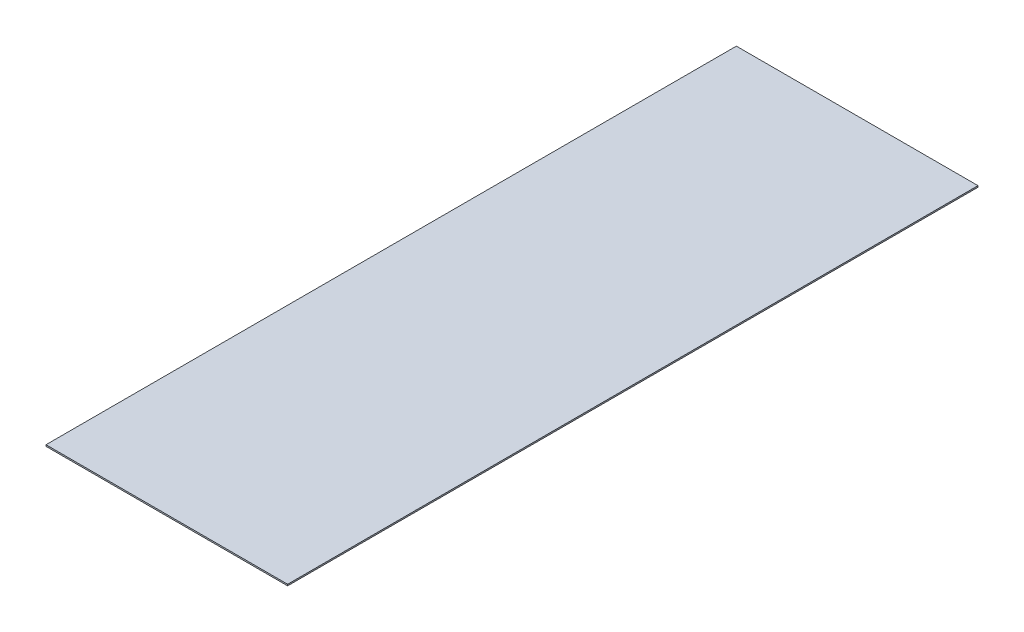
ISO-10303-21;
HEADER;
FILE_DESCRIPTION(('STEP AP214'),'2;1');
FILE_NAME('part.step','',(''),(''),'','','');
FILE_SCHEMA(('AUTOMOTIVE_DESIGN { 1 0 10303 214 1 1 1 1 }'));
ENDSEC;
DATA;
#1=APPLICATION_CONTEXT('core data for automotive mechanical design processes');
#2=APPLICATION_PROTOCOL_DEFINITION('international standard','automotive_design',2000,#1);
#3=PRODUCT_CONTEXT('',#1,'mechanical');
#4=PRODUCT('Part','Part','',(#3));
#5=PRODUCT_RELATED_PRODUCT_CATEGORY('part','',(#4));
#6=PRODUCT_DEFINITION_FORMATION('','',#4);
#7=PRODUCT_DEFINITION_CONTEXT('part definition',#1,'design');
#8=PRODUCT_DEFINITION('design','',#6,#7);
#9=PRODUCT_DEFINITION_SHAPE('','',#8);
#10=(LENGTH_UNIT() NAMED_UNIT(*) SI_UNIT(.MILLI.,.METRE.));
#11=(NAMED_UNIT(*) PLANE_ANGLE_UNIT() SI_UNIT($,.RADIAN.));
#12=(NAMED_UNIT(*) SI_UNIT($,.STERADIAN.) SOLID_ANGLE_UNIT());
#13=UNCERTAINTY_MEASURE_WITH_UNIT(LENGTH_MEASURE(1.E-05),#10,'distance_accuracy_value','');
#14=(GEOMETRIC_REPRESENTATION_CONTEXT(3) GLOBAL_UNCERTAINTY_ASSIGNED_CONTEXT((#13)) GLOBAL_UNIT_ASSIGNED_CONTEXT((#10,
#11,#12)) REPRESENTATION_CONTEXT('',''));
#15=CARTESIAN_POINT('',(0.,0.,0.));
#16=DIRECTION('',(0.,0.,1.));
#17=DIRECTION('',(1.,0.,0.));
#18=AXIS2_PLACEMENT_3D('',#15,#16,#17);
#19=CARTESIAN_POINT('',(0.,0.,0.));
#20=DIRECTION('',(0.,-1.,0.));
#21=DIRECTION('',(0.,0.,-1.));
#22=AXIS2_PLACEMENT_3D('',#19,#20,#21);
#23=PLANE('',#22);
#24=DIRECTION('',(1.,0.,0.));
#25=VECTOR('',#24,1.);
#26=CARTESIAN_POINT('',(533.4,0.,-3048.));
#27=LINE('',#26,#25);
#28=CARTESIAN_POINT('',(0.,0.,-3048.));
#29=VERTEX_POINT('',#28);
#30=CARTESIAN_POINT('',(1066.8,0.,-3048.));
#31=VERTEX_POINT('',#30);
#32=EDGE_CURVE('E77',#29,#31,#27,.T.);
#33=ORIENTED_EDGE('',*,*,#32,.T.);
#34=DIRECTION('',(0.,0.,1.));
#35=VECTOR('',#34,1.);
#36=CARTESIAN_POINT('',(1066.8,0.,-1524.));
#37=LINE('',#36,#35);
#38=CARTESIAN_POINT('',(1066.8,0.,0.));
#39=VERTEX_POINT('',#38);
#40=EDGE_CURVE('E59',#31,#39,#37,.T.);
#41=ORIENTED_EDGE('',*,*,#40,.T.);
#42=DIRECTION('',(-1.,0.,0.));
#43=VECTOR('',#42,1.);
#44=CARTESIAN_POINT('',(533.4,0.,0.));
#45=LINE('',#44,#43);
#46=CARTESIAN_POINT('',(0.,0.,0.));
#47=VERTEX_POINT('',#46);
#48=EDGE_CURVE('E21',#39,#47,#45,.T.);
#49=ORIENTED_EDGE('',*,*,#48,.T.);
#50=DIRECTION('',(0.,0.,-1.));
#51=VECTOR('',#50,1.);
#52=CARTESIAN_POINT('',(0.,0.,-1524.));
#53=LINE('',#52,#51);
#54=EDGE_CURVE('E56',#47,#29,#53,.T.);
#55=ORIENTED_EDGE('',*,*,#54,.T.);
#56=EDGE_LOOP('',(#33,#41,#49,#55));
#57=FACE_BOUND('',#56,.T.);
#58=ADVANCED_FACE('F17',(#57),#23,.T.);
#59=CARTESIAN_POINT('',(1066.8,0.,0.));
#60=DIRECTION('',(0.,0.,-1.));
#61=DIRECTION('',(-1.,0.,0.));
#62=AXIS2_PLACEMENT_3D('',#59,#60,#61);
#63=PLANE('',#62);
#64=DIRECTION('',(0.,-1.,0.));
#65=VECTOR('',#64,1.);
#66=CARTESIAN_POINT('',(0.,3.175,0.));
#67=LINE('',#66,#65);
#68=CARTESIAN_POINT('',(0.,6.35,0.));
#69=VERTEX_POINT('',#68);
#70=EDGE_CURVE('E64',#69,#47,#67,.T.);
#71=ORIENTED_EDGE('',*,*,#70,.T.);
#72=ORIENTED_EDGE('',*,*,#48,.F.);
#73=DIRECTION('',(0.,1.,0.));
#74=VECTOR('',#73,1.);
#75=CARTESIAN_POINT('',(1066.8,3.175,0.));
#76=LINE('',#75,#74);
#77=CARTESIAN_POINT('',(1066.8,6.35,0.));
#78=VERTEX_POINT('',#77);
#79=EDGE_CURVE('E81',#39,#78,#76,.T.);
#80=ORIENTED_EDGE('',*,*,#79,.T.);
#81=DIRECTION('',(-1.,0.,0.));
#82=VECTOR('',#81,1.);
#83=CARTESIAN_POINT('',(533.4,6.35,0.));
#84=LINE('',#83,#82);
#85=EDGE_CURVE('E74',#78,#69,#84,.T.);
#86=ORIENTED_EDGE('',*,*,#85,.T.);
#87=EDGE_LOOP('',(#71,#72,#80,#86));
#88=FACE_BOUND('',#87,.T.);
#89=ADVANCED_FACE('F73',(#88),#63,.F.);
#90=CARTESIAN_POINT('',(0.,0.,0.));
#91=DIRECTION('',(1.,0.,0.));
#92=DIRECTION('',(0.,0.,-1.));
#93=AXIS2_PLACEMENT_3D('',#90,#91,#92);
#94=PLANE('',#93);
#95=DIRECTION('',(0.,-1.,0.));
#96=VECTOR('',#95,1.);
#97=CARTESIAN_POINT('',(0.,3.175,-3048.));
#98=LINE('',#97,#96);
#99=CARTESIAN_POINT('',(0.,6.35,-3048.));
#100=VERTEX_POINT('',#99);
#101=EDGE_CURVE('E70',#100,#29,#98,.T.);
#102=ORIENTED_EDGE('',*,*,#101,.T.);
#103=ORIENTED_EDGE('',*,*,#54,.F.);
#104=ORIENTED_EDGE('',*,*,#70,.F.);
#105=DIRECTION('',(0.,0.,-1.));
#106=VECTOR('',#105,1.);
#107=CARTESIAN_POINT('',(0.,6.35,-1524.));
#108=LINE('',#107,#106);
#109=EDGE_CURVE('E84',#69,#100,#108,.T.);
#110=ORIENTED_EDGE('',*,*,#109,.T.);
#111=EDGE_LOOP('',(#102,#103,#104,#110));
#112=FACE_BOUND('',#111,.T.);
#113=ADVANCED_FACE('F67',(#112),#94,.F.);
#114=CARTESIAN_POINT('',(0.,0.,-3048.));
#115=DIRECTION('',(0.,0.,1.));
#116=DIRECTION('',(1.,0.,0.));
#117=AXIS2_PLACEMENT_3D('',#114,#115,#116);
#118=PLANE('',#117);
#119=DIRECTION('',(0.,-1.,0.));
#120=VECTOR('',#119,1.);
#121=CARTESIAN_POINT('',(1066.8,3.175,-3048.));
#122=LINE('',#121,#120);
#123=CARTESIAN_POINT('',(1066.8,6.35,-3048.));
#124=VERTEX_POINT('',#123);
#125=EDGE_CURVE('E35',#124,#31,#122,.T.);
#126=ORIENTED_EDGE('',*,*,#125,.T.);
#127=ORIENTED_EDGE('',*,*,#32,.F.);
#128=ORIENTED_EDGE('',*,*,#101,.F.);
#129=DIRECTION('',(1.,0.,0.));
#130=VECTOR('',#129,1.);
#131=CARTESIAN_POINT('',(533.4,6.35,-3048.));
#132=LINE('',#131,#130);
#133=EDGE_CURVE('E27',#100,#124,#132,.T.);
#134=ORIENTED_EDGE('',*,*,#133,.T.);
#135=EDGE_LOOP('',(#126,#127,#128,#134));
#136=FACE_BOUND('',#135,.T.);
#137=ADVANCED_FACE('F89',(#136),#118,.F.);
#138=CARTESIAN_POINT('',(1066.8,0.,-3048.));
#139=DIRECTION('',(-1.,0.,0.));
#140=DIRECTION('',(0.,0.,1.));
#141=AXIS2_PLACEMENT_3D('',#138,#139,#140);
#142=PLANE('',#141);
#143=ORIENTED_EDGE('',*,*,#79,.F.);
#144=ORIENTED_EDGE('',*,*,#40,.F.);
#145=ORIENTED_EDGE('',*,*,#125,.F.);
#146=DIRECTION('',(0.,0.,1.));
#147=VECTOR('',#146,1.);
#148=CARTESIAN_POINT('',(1066.8,6.35,-1524.));
#149=LINE('',#148,#147);
#150=EDGE_CURVE('E11',#124,#78,#149,.T.);
#151=ORIENTED_EDGE('',*,*,#150,.T.);
#152=EDGE_LOOP('',(#143,#144,#145,#151));
#153=FACE_BOUND('',#152,.T.);
#154=ADVANCED_FACE('F91',(#153),#142,.F.);
#155=CARTESIAN_POINT('',(0.,6.35,0.));
#156=DIRECTION('',(0.,-1.,0.));
#157=DIRECTION('',(0.,0.,-1.));
#158=AXIS2_PLACEMENT_3D('',#155,#156,#157);
#159=PLANE('',#158);
#160=ORIENTED_EDGE('',*,*,#133,.F.);
#161=ORIENTED_EDGE('',*,*,#109,.F.);
#162=ORIENTED_EDGE('',*,*,#85,.F.);
#163=ORIENTED_EDGE('',*,*,#150,.F.);
#164=EDGE_LOOP('',(#160,#161,#162,#163));
#165=FACE_BOUND('',#164,.T.);
#166=ADVANCED_FACE('F19',(#165),#159,.F.);
#167=CLOSED_SHELL('',(#58,#89,#113,#137,#154,#166));
#168=MANIFOLD_SOLID_BREP('B1',#167);
#169=ADVANCED_BREP_SHAPE_REPRESENTATION('',(#18,#168),#14);
#170=SHAPE_DEFINITION_REPRESENTATION(#9,#169);
ENDSEC;
END-ISO-10303-21;
